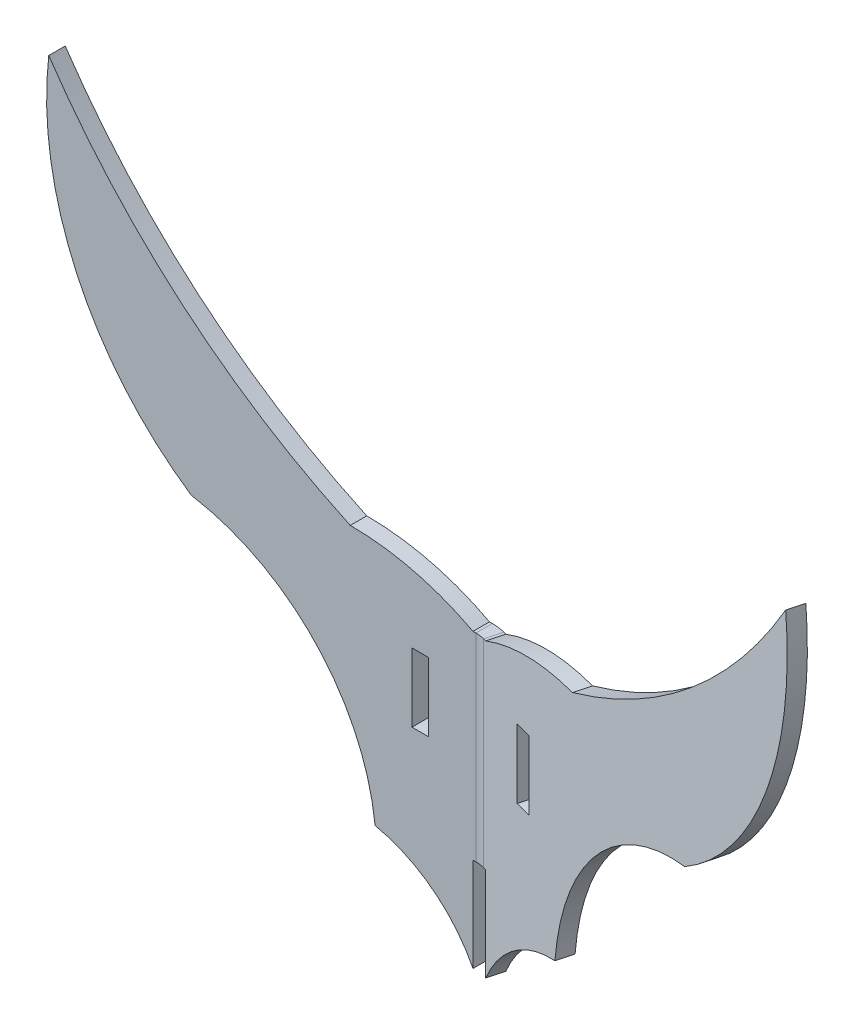
ISO-10303-21;
HEADER;
FILE_DESCRIPTION(('STEP AP214'),'2;1');
FILE_NAME('part.step','',(''),(''),'','','');
FILE_SCHEMA(('AUTOMOTIVE_DESIGN { 1 0 10303 214 1 1 1 1 }'));
ENDSEC;
DATA;
#1=APPLICATION_CONTEXT('core data for automotive mechanical design processes');
#2=APPLICATION_PROTOCOL_DEFINITION('international standard','automotive_design',2000,#1);
#3=PRODUCT_CONTEXT('',#1,'mechanical');
#4=PRODUCT('Part','Part','',(#3));
#5=PRODUCT_RELATED_PRODUCT_CATEGORY('part','',(#4));
#6=PRODUCT_DEFINITION_FORMATION('','',#4);
#7=PRODUCT_DEFINITION_CONTEXT('part definition',#1,'design');
#8=PRODUCT_DEFINITION('design','',#6,#7);
#9=PRODUCT_DEFINITION_SHAPE('','',#8);
#10=(LENGTH_UNIT() NAMED_UNIT(*) SI_UNIT(.MILLI.,.METRE.));
#11=(NAMED_UNIT(*) PLANE_ANGLE_UNIT() SI_UNIT($,.RADIAN.));
#12=(NAMED_UNIT(*) SI_UNIT($,.STERADIAN.) SOLID_ANGLE_UNIT());
#13=UNCERTAINTY_MEASURE_WITH_UNIT(LENGTH_MEASURE(1.E-05),#10,'distance_accuracy_value','');
#14=(GEOMETRIC_REPRESENTATION_CONTEXT(3) GLOBAL_UNCERTAINTY_ASSIGNED_CONTEXT((#13)) GLOBAL_UNIT_ASSIGNED_CONTEXT((#10,
#11,#12)) REPRESENTATION_CONTEXT('',''));
#15=CARTESIAN_POINT('',(0.,0.,0.));
#16=DIRECTION('',(0.,0.,1.));
#17=DIRECTION('',(1.,0.,0.));
#18=AXIS2_PLACEMENT_3D('',#15,#16,#17);
#19=CARTESIAN_POINT('',(12.759274172426,200.474249065526,3.23481289353456));
#20=DIRECTION('',(0.258819045102521,0.,-0.965925826289068));
#21=DIRECTION('',(-0.965925826289068,0.,-0.258819045102521));
#22=AXIS2_PLACEMENT_3D('',#19,#20,#21);
#23=PLANE('',#22);
#24=DIRECTION('',(0.965925826289068,0.,0.258819045102521));
#25=VECTOR('',#24,1.);
#26=CARTESIAN_POINT('',(5.33314516650484,223.0507730184,1.24498762350864));
#27=LINE('',#26,#25);
#28=CARTESIAN_POINT('',(5.33314516650484,223.0507730184,1.24498762350864));
#29=VERTEX_POINT('',#28);
#30=CARTESIAN_POINT('',(6.80521612576938,223.0507730184,1.63942784824488));
#31=VERTEX_POINT('',#30);
#32=EDGE_CURVE('E340',#29,#31,#27,.T.);
#33=ORIENTED_EDGE('',*,*,#32,.F.);
#34=DIRECTION('',(0.,-1.,0.));
#35=VECTOR('',#34,1.);
#36=CARTESIAN_POINT('',(5.33314516650484,229.4007730184,1.24498762350864));
#37=LINE('',#36,#35);
#38=CARTESIAN_POINT('',(5.33314516650484,229.4007730184,1.24498762350864));
#39=VERTEX_POINT('',#38);
#40=EDGE_CURVE('E338',#39,#29,#37,.T.);
#41=ORIENTED_EDGE('',*,*,#40,.F.);
#42=DIRECTION('',(-0.965925826289068,0.,-0.258819045102521));
#43=VECTOR('',#42,1.);
#44=CARTESIAN_POINT('',(5.33314516650484,229.4007730184,1.24498762350864));
#45=LINE('',#44,#43);
#46=CARTESIAN_POINT('',(6.80521612576938,229.4007730184,1.63942784824488));
#47=VERTEX_POINT('',#46);
#48=EDGE_CURVE('E328',#47,#39,#45,.T.);
#49=ORIENTED_EDGE('',*,*,#48,.F.);
#50=DIRECTION('',(0.,1.,0.));
#51=VECTOR('',#50,1.);
#52=CARTESIAN_POINT('',(6.80521612576938,229.4007730184,1.63942784824488));
#53=LINE('',#52,#51);
#54=EDGE_CURVE('E344',#31,#47,#53,.T.);
#55=ORIENTED_EDGE('',*,*,#54,.F.);
#56=EDGE_LOOP('',(#33,#41,#49,#55));
#57=FACE_BOUND('',#56,.T.);
#58=DIRECTION('',(-0.965925826289068,0.,-0.258819045102521));
#59=VECTOR('',#58,1.);
#60=CARTESIAN_POINT('',(-0.121896494760621,233.551760084195,-0.216686384305577));
#61=LINE('',#60,#59);
#62=CARTESIAN_POINT('',(1.35017446450392,233.551760084195,0.177753840430666));
#63=VERTEX_POINT('',#62);
#64=CARTESIAN_POINT('',(1.09054188913671,233.551760084195,0.108185501532209));
#65=VERTEX_POINT('',#64);
#66=EDGE_CURVE('E64',#63,#65,#61,.T.);
#67=ORIENTED_EDGE('',*,*,#66,.T.);
#68=DIRECTION('',(0.,-1.,0.));
#69=VECTOR('',#68,1.);
#70=CARTESIAN_POINT('',(1.09054188913671,200.474249065526,0.108185501532209));
#71=LINE('',#70,#69);
#72=CARTESIAN_POINT('',(1.09054188913671,215.212870579898,0.108185501532209));
#73=VERTEX_POINT('',#72);
#74=EDGE_CURVE('E56',#65,#73,#71,.T.);
#75=ORIENTED_EDGE('',*,*,#74,.T.);
#76=DIRECTION('',(0.965925826289068,0.,0.258819045102521));
#77=VECTOR('',#76,1.);
#78=CARTESIAN_POINT('',(0.614138984871649,215.212870579898,-0.0194662719374556));
#79=LINE('',#78,#77);
#80=CARTESIAN_POINT('',(1.35017446450392,215.212870579898,0.177753840430666));
#81=VERTEX_POINT('',#80);
#82=EDGE_CURVE('E72',#73,#81,#79,.T.);
#83=ORIENTED_EDGE('',*,*,#82,.T.);
#84=DIRECTION('',(0.,-1.,0.));
#85=VECTOR('',#84,1.);
#86=CARTESIAN_POINT('',(1.35017446450392,215.212870579898,0.177753840430666));
#87=LINE('',#86,#85);
#88=CARTESIAN_POINT('',(1.35017446450392,206.537075799162,0.177753840430666));
#89=VERTEX_POINT('',#88);
#90=EDGE_CURVE('E376',#81,#89,#87,.T.);
#91=ORIENTED_EDGE('',*,*,#90,.T.);
#92=CARTESIAN_POINT('',(12.759274172426,200.474249065526,3.23481289353456));
#93=DIRECTION('',(0.258819045102521,0.,-0.965925826289068));
#94=DIRECTION('',(-0.965925826289068,0.,-0.258819045102521));
#95=AXIS2_PLACEMENT_3D('',#92,#93,#94);
#96=CIRCLE('',#95,13.2767102175786);
#97=CARTESIAN_POINT('',(10.1017325464061,213.462760914363,2.52272676099043));
#98=VERTEX_POINT('',#97);
#99=EDGE_CURVE('E379',#89,#98,#96,.T.);
#100=ORIENTED_EDGE('',*,*,#99,.T.);
#101=CARTESIAN_POINT('',(29.7279997646015,211.251059383277,7.7815692125433));
#102=DIRECTION('',(0.258819045102521,0.,-0.965925826289068));
#103=DIRECTION('',(-0.965925826289068,0.,-0.258819045102521));
#104=AXIS2_PLACEMENT_3D('',#101,#102,#103);
#105=CIRCLE('',#104,20.4386255044921);
#106=CARTESIAN_POINT('',(26.525494774196,231.418980046682,6.92346058660752));
#107=VERTEX_POINT('',#106);
#108=EDGE_CURVE('E382',#98,#107,#105,.T.);
#109=ORIENTED_EDGE('',*,*,#108,.T.);
#110=CARTESIAN_POINT('',(10.1387816985333,256.594170402523,2.53265405138316));
#111=DIRECTION('',(-0.258819045102521,0.,0.965925826289068));
#112=DIRECTION('',(0.965925826289068,0.,0.258819045102521));
#113=AXIS2_PLACEMENT_3D('',#110,#111,#112);
#114=CIRCLE('',#113,30.3577627124715);
#115=CARTESIAN_POINT('',(39.2695493411971,260.067681322201,10.3382197161336));
#116=VERTEX_POINT('',#115);
#117=EDGE_CURVE('E385',#107,#116,#114,.T.);
#118=ORIENTED_EDGE('',*,*,#117,.T.);
#119=CARTESIAN_POINT('',(-15.283177393454,298.27200828736,-4.27913935733189));
#120=DIRECTION('',(0.258819045102521,0.,-0.965925826289068));
#121=DIRECTION('',(-0.965925826289068,0.,-0.258819045102521));
#122=AXIS2_PLACEMENT_3D('',#119,#120,#121);
#123=CIRCLE('',#122,68.1853193827592);
#124=CARTESIAN_POINT('',(12.3207421256857,236.364383843072,3.11730858575531));
#125=VERTEX_POINT('',#124);
#126=EDGE_CURVE('E388',#116,#125,#123,.T.);
#127=ORIENTED_EDGE('',*,*,#126,.T.);
#128=CARTESIAN_POINT('',(12.3207421256856,212.026754452324,3.11730858575531));
#129=DIRECTION('',(-0.258819045102521,0.,0.965925826289068));
#130=DIRECTION('',(0.965925826289068,0.,0.258819045102521));
#131=AXIS2_PLACEMENT_3D('',#128,#129,#130);
#132=CIRCLE('',#131,24.3376293907481);
#133=EDGE_CURVE('E391',#125,#63,#132,.T.);
#134=ORIENTED_EDGE('',*,*,#133,.T.);
#135=EDGE_LOOP('',(#67,#75,#83,#91,#100,#109,#118,#127,#134));
#136=FACE_BOUND('',#135,.T.);
#137=ADVANCED_FACE('F47',(#57,#136),#23,.F.);
#138=CARTESIAN_POINT('',(0.272543729975622,233.551760084195,-1.68875734357012));
#139=DIRECTION('',(0.,1.,0.));
#140=DIRECTION('',(-0.258819045102521,0.,0.965925826289068));
#141=AXIS2_PLACEMENT_3D('',#138,#139,#140);
#142=PLANE('',#141);
#143=DIRECTION('',(0.258819045102521,0.,-0.965925826289068));
#144=VECTOR('',#143,1.);
#145=CARTESIAN_POINT('',(1.48498211387295,233.551760084195,-1.36388545773233));
#146=LINE('',#145,#144);
#147=CARTESIAN_POINT('',(1.48498211387295,233.551760084195,-1.36388545773233));
#148=VERTEX_POINT('',#147);
#149=EDGE_CURVE('E12',#65,#148,#146,.T.);
#150=ORIENTED_EDGE('',*,*,#149,.F.);
#151=ORIENTED_EDGE('',*,*,#66,.F.);
#152=DIRECTION('',(-0.258819045102521,0.,0.965925826289068));
#153=VECTOR('',#152,1.);
#154=CARTESIAN_POINT('',(1.74461468924016,233.551760084195,-1.29431711883387));
#155=LINE('',#154,#153);
#156=CARTESIAN_POINT('',(1.74461468924016,233.551760084195,-1.29431711883387));
#157=VERTEX_POINT('',#156);
#158=EDGE_CURVE('E393',#157,#63,#155,.T.);
#159=ORIENTED_EDGE('',*,*,#158,.F.);
#160=DIRECTION('',(-0.965925826289068,0.,-0.258819045102521));
#161=VECTOR('',#160,1.);
#162=CARTESIAN_POINT('',(0.272543729975622,233.551760084195,-1.68875734357012));
#163=LINE('',#162,#161);
#164=EDGE_CURVE('E375',#157,#148,#163,.T.);
#165=ORIENTED_EDGE('',*,*,#164,.T.);
#166=EDGE_LOOP('',(#150,#151,#159,#165));
#167=FACE_BOUND('',#166,.T.);
#168=ADVANCED_FACE('F49',(#167),#142,.T.);
#169=CARTESIAN_POINT('',(12.7151823504219,212.026754452324,1.64523762649077));
#170=DIRECTION('',(-0.258819045102521,0.,0.965925826289068));
#171=DIRECTION('',(0.965925826289068,0.,0.258819045102521));
#172=AXIS2_PLACEMENT_3D('',#169,#170,#171);
#173=CYLINDRICAL_SURFACE('',#172,24.3376293907481);
#174=ORIENTED_EDGE('',*,*,#133,.F.);
#175=DIRECTION('',(-0.258819045102521,0.,0.965925826289068));
#176=VECTOR('',#175,1.);
#177=CARTESIAN_POINT('',(12.7151823504219,236.364383843072,1.64523762649077));
#178=LINE('',#177,#176);
#179=CARTESIAN_POINT('',(12.7151823504219,236.364383843072,1.64523762649077));
#180=VERTEX_POINT('',#179);
#181=EDGE_CURVE('E395',#180,#125,#178,.T.);
#182=ORIENTED_EDGE('',*,*,#181,.F.);
#183=CARTESIAN_POINT('',(12.7151823504219,212.026754452324,1.64523762649077));
#184=DIRECTION('',(-0.258819045102521,0.,0.965925826289068));
#185=DIRECTION('',(0.965925826289068,0.,0.258819045102521));
#186=AXIS2_PLACEMENT_3D('',#183,#184,#185);
#187=CIRCLE('',#186,24.3376293907481);
#188=EDGE_CURVE('E372',#180,#157,#187,.T.);
#189=ORIENTED_EDGE('',*,*,#188,.T.);
#190=ORIENTED_EDGE('',*,*,#158,.T.);
#191=EDGE_LOOP('',(#174,#182,#189,#190));
#192=FACE_BOUND('',#191,.T.);
#193=ADVANCED_FACE('F511',(#192),#173,.T.);
#194=CARTESIAN_POINT('',(-14.8887371687178,298.27200828736,-5.75121031659643));
#195=DIRECTION('',(-0.258819045102521,0.,0.965925826289068));
#196=DIRECTION('',(0.965925826289068,0.,0.258819045102521));
#197=AXIS2_PLACEMENT_3D('',#194,#195,#196);
#198=CYLINDRICAL_SURFACE('',#197,68.1853193827592);
#199=ORIENTED_EDGE('',*,*,#126,.F.);
#200=DIRECTION('',(-0.258819045102521,0.,0.965925826289068));
#201=VECTOR('',#200,1.);
#202=CARTESIAN_POINT('',(39.6639895659333,260.067681322201,8.86614875686909));
#203=LINE('',#202,#201);
#204=CARTESIAN_POINT('',(39.6639895659333,260.067681322201,8.86614875686909));
#205=VERTEX_POINT('',#204);
#206=EDGE_CURVE('E397',#205,#116,#203,.T.);
#207=ORIENTED_EDGE('',*,*,#206,.F.);
#208=CARTESIAN_POINT('',(-14.8887371687178,298.27200828736,-5.75121031659643));
#209=DIRECTION('',(0.258819045102521,0.,-0.965925826289068));
#210=DIRECTION('',(-0.965925826289068,0.,-0.258819045102521));
#211=AXIS2_PLACEMENT_3D('',#208,#209,#210);
#212=CIRCLE('',#211,68.1853193827592);
#213=EDGE_CURVE('E369',#205,#180,#212,.T.);
#214=ORIENTED_EDGE('',*,*,#213,.T.);
#215=ORIENTED_EDGE('',*,*,#181,.T.);
#216=EDGE_LOOP('',(#199,#207,#214,#215));
#217=FACE_BOUND('',#216,.T.);
#218=ADVANCED_FACE('F531',(#217),#198,.F.);
#219=CARTESIAN_POINT('',(10.5332219232695,256.594170402523,1.06058309211862));
#220=DIRECTION('',(-0.258819045102521,0.,0.965925826289068));
#221=DIRECTION('',(0.965925826289068,0.,0.258819045102521));
#222=AXIS2_PLACEMENT_3D('',#219,#220,#221);
#223=CYLINDRICAL_SURFACE('',#222,30.3577627124715);
#224=ORIENTED_EDGE('',*,*,#117,.F.);
#225=DIRECTION('',(-0.258819045102521,0.,0.965925826289068));
#226=VECTOR('',#225,1.);
#227=CARTESIAN_POINT('',(26.9199349989323,231.418980046682,5.45138962734298));
#228=LINE('',#227,#226);
#229=CARTESIAN_POINT('',(26.9199349989323,231.418980046682,5.45138962734298));
#230=VERTEX_POINT('',#229);
#231=EDGE_CURVE('E399',#230,#107,#228,.T.);
#232=ORIENTED_EDGE('',*,*,#231,.F.);
#233=CARTESIAN_POINT('',(10.5332219232695,256.594170402523,1.06058309211862));
#234=DIRECTION('',(-0.258819045102521,0.,0.965925826289068));
#235=DIRECTION('',(0.965925826289068,0.,0.258819045102521));
#236=AXIS2_PLACEMENT_3D('',#233,#234,#235);
#237=CIRCLE('',#236,30.3577627124715);
#238=EDGE_CURVE('E366',#230,#205,#237,.T.);
#239=ORIENTED_EDGE('',*,*,#238,.T.);
#240=ORIENTED_EDGE('',*,*,#206,.T.);
#241=EDGE_LOOP('',(#224,#232,#239,#240));
#242=FACE_BOUND('',#241,.T.);
#243=ADVANCED_FACE('F527',(#242),#223,.T.);
#244=CARTESIAN_POINT('',(30.1224399893377,211.251059383277,6.30949825327876));
#245=DIRECTION('',(-0.258819045102521,0.,0.965925826289068));
#246=DIRECTION('',(0.965925826289068,0.,0.258819045102521));
#247=AXIS2_PLACEMENT_3D('',#244,#245,#246);
#248=CYLINDRICAL_SURFACE('',#247,20.4386255044921);
#249=ORIENTED_EDGE('',*,*,#108,.F.);
#250=DIRECTION('',(-0.258819045102521,0.,0.965925826289068));
#251=VECTOR('',#250,1.);
#252=CARTESIAN_POINT('',(10.4961727711423,213.462760914363,1.05065580172589));
#253=LINE('',#252,#251);
#254=CARTESIAN_POINT('',(10.4961727711423,213.462760914363,1.05065580172589));
#255=VERTEX_POINT('',#254);
#256=EDGE_CURVE('E401',#255,#98,#253,.T.);
#257=ORIENTED_EDGE('',*,*,#256,.F.);
#258=CARTESIAN_POINT('',(30.1224399893377,211.251059383277,6.30949825327876));
#259=DIRECTION('',(0.258819045102521,0.,-0.965925826289068));
#260=DIRECTION('',(-0.965925826289068,0.,-0.258819045102521));
#261=AXIS2_PLACEMENT_3D('',#258,#259,#260);
#262=CIRCLE('',#261,20.4386255044921);
#263=EDGE_CURVE('E363',#255,#230,#262,.T.);
#264=ORIENTED_EDGE('',*,*,#263,.T.);
#265=ORIENTED_EDGE('',*,*,#231,.T.);
#266=EDGE_LOOP('',(#249,#257,#264,#265));
#267=FACE_BOUND('',#266,.T.);
#268=ADVANCED_FACE('F524',(#267),#248,.F.);
#269=CARTESIAN_POINT('',(13.1537143971623,200.474249065526,1.76274193427002));
#270=DIRECTION('',(-0.258819045102521,0.,0.965925826289068));
#271=DIRECTION('',(0.965925826289068,0.,0.258819045102521));
#272=AXIS2_PLACEMENT_3D('',#269,#270,#271);
#273=CYLINDRICAL_SURFACE('',#272,13.2767102175786);
#274=ORIENTED_EDGE('',*,*,#99,.F.);
#275=DIRECTION('',(-0.258819045102521,0.,0.965925826289068));
#276=VECTOR('',#275,1.);
#277=CARTESIAN_POINT('',(1.74461468924016,206.537075799162,-1.29431711883387));
#278=LINE('',#277,#276);
#279=CARTESIAN_POINT('',(1.74461468924016,206.537075799162,-1.29431711883387));
#280=VERTEX_POINT('',#279);
#281=EDGE_CURVE('E403',#280,#89,#278,.T.);
#282=ORIENTED_EDGE('',*,*,#281,.F.);
#283=CARTESIAN_POINT('',(13.1537143971623,200.474249065526,1.76274193427002));
#284=DIRECTION('',(0.258819045102521,0.,-0.965925826289068));
#285=DIRECTION('',(-0.965925826289068,0.,-0.258819045102521));
#286=AXIS2_PLACEMENT_3D('',#283,#284,#285);
#287=CIRCLE('',#286,13.2767102175786);
#288=EDGE_CURVE('E360',#280,#255,#287,.T.);
#289=ORIENTED_EDGE('',*,*,#288,.T.);
#290=ORIENTED_EDGE('',*,*,#256,.T.);
#291=EDGE_LOOP('',(#274,#282,#289,#290));
#292=FACE_BOUND('',#291,.T.);
#293=ADVANCED_FACE('F428',(#292),#273,.F.);
#294=CARTESIAN_POINT('',(1.74461468924016,215.212870579898,-1.29431711883387));
#295=DIRECTION('',(-0.965925826289068,0.,-0.258819045102521));
#296=DIRECTION('',(-0.258819045102521,0.,0.965925826289068));
#297=AXIS2_PLACEMENT_3D('',#294,#295,#296);
#298=PLANE('',#297);
#299=ORIENTED_EDGE('',*,*,#90,.F.);
#300=DIRECTION('',(-0.258819045102521,0.,0.965925826289068));
#301=VECTOR('',#300,1.);
#302=CARTESIAN_POINT('',(1.74461468924016,215.212870579898,-1.29431711883387));
#303=LINE('',#302,#301);
#304=CARTESIAN_POINT('',(1.74461468924016,215.212870579898,-1.29431711883387));
#305=VERTEX_POINT('',#304);
#306=EDGE_CURVE('E405',#305,#81,#303,.T.);
#307=ORIENTED_EDGE('',*,*,#306,.F.);
#308=DIRECTION('',(0.,-1.,0.));
#309=VECTOR('',#308,1.);
#310=CARTESIAN_POINT('',(1.74461468924016,215.212870579898,-1.29431711883387));
#311=LINE('',#310,#309);
#312=EDGE_CURVE('E357',#305,#280,#311,.T.);
#313=ORIENTED_EDGE('',*,*,#312,.T.);
#314=ORIENTED_EDGE('',*,*,#281,.T.);
#315=EDGE_LOOP('',(#299,#307,#313,#314));
#316=FACE_BOUND('',#315,.T.);
#317=ADVANCED_FACE('F420',(#316),#298,.T.);
#318=CARTESIAN_POINT('',(1.00857920960789,215.212870579898,-1.491537231202));
#319=DIRECTION('',(0.,-1.,0.));
#320=DIRECTION('',(0.258819045102521,0.,-0.965925826289068));
#321=AXIS2_PLACEMENT_3D('',#318,#319,#320);
#322=PLANE('',#321);
#323=DIRECTION('',(-0.258819045102521,0.,0.965925826289068));
#324=VECTOR('',#323,1.);
#325=CARTESIAN_POINT('',(1.48498211387295,215.212870579898,-1.36388545773233));
#326=LINE('',#325,#324);
#327=CARTESIAN_POINT('',(1.48498211387295,215.212870579898,-1.36388545773233));
#328=VERTEX_POINT('',#327);
#329=EDGE_CURVE('E408',#328,#73,#326,.T.);
#330=ORIENTED_EDGE('',*,*,#329,.F.);
#331=DIRECTION('',(0.965925826289068,0.,0.258819045102521));
#332=VECTOR('',#331,1.);
#333=CARTESIAN_POINT('',(0.272543729975621,215.212870579898,-1.68875734357012));
#334=LINE('',#333,#332);
#335=EDGE_CURVE('E51',#328,#305,#334,.T.);
#336=ORIENTED_EDGE('',*,*,#335,.T.);
#337=ORIENTED_EDGE('',*,*,#306,.T.);
#338=ORIENTED_EDGE('',*,*,#82,.F.);
#339=EDGE_LOOP('',(#330,#336,#337,#338));
#340=FACE_BOUND('',#339,.T.);
#341=ADVANCED_FACE('F415',(#340),#322,.T.);
#342=CARTESIAN_POINT('',(13.1537143971623,200.474249065526,1.76274193427002));
#343=DIRECTION('',(0.258819045102521,0.,-0.965925826289068));
#344=DIRECTION('',(-0.965925826289068,0.,-0.258819045102521));
#345=AXIS2_PLACEMENT_3D('',#342,#343,#344);
#346=PLANE('',#345);
#347=DIRECTION('',(0.,-1.,0.));
#348=VECTOR('',#347,1.);
#349=CARTESIAN_POINT('',(1.48498211387295,200.474249065526,-1.36388545773233));
#350=LINE('',#349,#348);
#351=EDGE_CURVE('E243',#148,#328,#350,.T.);
#352=ORIENTED_EDGE('',*,*,#351,.F.);
#353=ORIENTED_EDGE('',*,*,#164,.F.);
#354=ORIENTED_EDGE('',*,*,#188,.F.);
#355=ORIENTED_EDGE('',*,*,#213,.F.);
#356=ORIENTED_EDGE('',*,*,#238,.F.);
#357=ORIENTED_EDGE('',*,*,#263,.F.);
#358=ORIENTED_EDGE('',*,*,#288,.F.);
#359=ORIENTED_EDGE('',*,*,#312,.F.);
#360=ORIENTED_EDGE('',*,*,#335,.F.);
#361=EDGE_LOOP('',(#352,#353,#354,#355,#356,#357,#358,#359,#360));
#362=FACE_BOUND('',#361,.T.);
#363=DIRECTION('',(0.,-1.,0.));
#364=VECTOR('',#363,1.);
#365=CARTESIAN_POINT('',(5.72758539124108,229.4007730184,-0.227083335755904));
#366=LINE('',#365,#364);
#367=CARTESIAN_POINT('',(5.72758539124108,229.4007730184,-0.227083335755904));
#368=VERTEX_POINT('',#367);
#369=CARTESIAN_POINT('',(5.72758539124108,223.0507730184,-0.227083335755904));
#370=VERTEX_POINT('',#369);
#371=EDGE_CURVE('E324',#368,#370,#366,.T.);
#372=ORIENTED_EDGE('',*,*,#371,.T.);
#373=DIRECTION('',(0.965925826289068,0.,0.258819045102521));
#374=VECTOR('',#373,1.);
#375=CARTESIAN_POINT('',(5.72758539124108,223.0507730184,-0.227083335755904));
#376=LINE('',#375,#374);
#377=CARTESIAN_POINT('',(7.19965635050562,223.0507730184,0.167356888980339));
#378=VERTEX_POINT('',#377);
#379=EDGE_CURVE('E327',#370,#378,#376,.T.);
#380=ORIENTED_EDGE('',*,*,#379,.T.);
#381=DIRECTION('',(0.,1.,0.));
#382=VECTOR('',#381,1.);
#383=CARTESIAN_POINT('',(7.19965635050562,229.4007730184,0.167356888980339));
#384=LINE('',#383,#382);
#385=CARTESIAN_POINT('',(7.19965635050562,229.4007730184,0.167356888980339));
#386=VERTEX_POINT('',#385);
#387=EDGE_CURVE('E331',#378,#386,#384,.T.);
#388=ORIENTED_EDGE('',*,*,#387,.T.);
#389=DIRECTION('',(-0.965925826289068,0.,-0.258819045102521));
#390=VECTOR('',#389,1.);
#391=CARTESIAN_POINT('',(5.72758539124108,229.4007730184,-0.227083335755904));
#392=LINE('',#391,#390);
#393=EDGE_CURVE('E334',#386,#368,#392,.T.);
#394=ORIENTED_EDGE('',*,*,#393,.T.);
#395=EDGE_LOOP('',(#372,#380,#388,#394));
#396=FACE_BOUND('',#395,.T.);
#397=ADVANCED_FACE('F422',(#362,#396),#346,.T.);
#398=CARTESIAN_POINT('',(5.72758539124108,229.4007730184,-0.227083335755904));
#399=DIRECTION('',(-0.965925826289068,0.,-0.258819045102521));
#400=DIRECTION('',(0.,-1.,0.));
#401=AXIS2_PLACEMENT_3D('',#398,#399,#400);
#402=PLANE('',#401);
#403=ORIENTED_EDGE('',*,*,#40,.T.);
#404=DIRECTION('',(-0.258819045102521,0.,0.965925826289068));
#405=VECTOR('',#404,1.);
#406=CARTESIAN_POINT('',(5.72758539124108,223.0507730184,-0.227083335755904));
#407=LINE('',#406,#405);
#408=EDGE_CURVE('E337',#370,#29,#407,.T.);
#409=ORIENTED_EDGE('',*,*,#408,.F.);
#410=ORIENTED_EDGE('',*,*,#371,.F.);
#411=DIRECTION('',(-0.258819045102521,0.,0.965925826289068));
#412=VECTOR('',#411,1.);
#413=CARTESIAN_POINT('',(5.72758539124108,229.4007730184,-0.227083335755904));
#414=LINE('',#413,#412);
#415=EDGE_CURVE('E349',#368,#39,#414,.T.);
#416=ORIENTED_EDGE('',*,*,#415,.T.);
#417=EDGE_LOOP('',(#403,#409,#410,#416));
#418=FACE_BOUND('',#417,.T.);
#419=ADVANCED_FACE('F519',(#418),#402,.F.);
#420=CARTESIAN_POINT('',(5.72758539124108,229.4007730184,-0.227083335755904));
#421=DIRECTION('',(0.,1.,0.));
#422=DIRECTION('',(-0.258819045102521,0.,0.965925826289068));
#423=AXIS2_PLACEMENT_3D('',#420,#421,#422);
#424=PLANE('',#423);
#425=ORIENTED_EDGE('',*,*,#48,.T.);
#426=ORIENTED_EDGE('',*,*,#415,.F.);
#427=ORIENTED_EDGE('',*,*,#393,.F.);
#428=DIRECTION('',(-0.258819045102521,0.,0.965925826289068));
#429=VECTOR('',#428,1.);
#430=CARTESIAN_POINT('',(7.19965635050562,229.4007730184,0.167356888980339));
#431=LINE('',#430,#429);
#432=EDGE_CURVE('E351',#386,#47,#431,.T.);
#433=ORIENTED_EDGE('',*,*,#432,.T.);
#434=EDGE_LOOP('',(#425,#426,#427,#433));
#435=FACE_BOUND('',#434,.T.);
#436=ADVANCED_FACE('F541',(#435),#424,.F.);
#437=CARTESIAN_POINT('',(7.19965635050562,229.4007730184,0.167356888980339));
#438=DIRECTION('',(0.965925826289068,0.,0.258819045102521));
#439=DIRECTION('',(0.,1.,0.));
#440=AXIS2_PLACEMENT_3D('',#437,#438,#439);
#441=PLANE('',#440);
#442=ORIENTED_EDGE('',*,*,#54,.T.);
#443=ORIENTED_EDGE('',*,*,#432,.F.);
#444=ORIENTED_EDGE('',*,*,#387,.F.);
#445=DIRECTION('',(-0.258819045102521,0.,0.965925826289068));
#446=VECTOR('',#445,1.);
#447=CARTESIAN_POINT('',(7.19965635050562,223.0507730184,0.167356888980339));
#448=LINE('',#447,#446);
#449=EDGE_CURVE('E353',#378,#31,#448,.T.);
#450=ORIENTED_EDGE('',*,*,#449,.T.);
#451=EDGE_LOOP('',(#442,#443,#444,#450));
#452=FACE_BOUND('',#451,.T.);
#453=ADVANCED_FACE('F546',(#452),#441,.F.);
#454=CARTESIAN_POINT('',(5.72758539124108,223.0507730184,-0.227083335755904));
#455=DIRECTION('',(0.,-1.,0.));
#456=DIRECTION('',(0.258819045102521,0.,-0.965925826289068));
#457=AXIS2_PLACEMENT_3D('',#454,#455,#456);
#458=PLANE('',#457);
#459=ORIENTED_EDGE('',*,*,#32,.T.);
#460=ORIENTED_EDGE('',*,*,#449,.F.);
#461=ORIENTED_EDGE('',*,*,#379,.F.);
#462=ORIENTED_EDGE('',*,*,#408,.T.);
#463=EDGE_LOOP('',(#459,#460,#461,#462));
#464=FACE_BOUND('',#463,.T.);
#465=ADVANCED_FACE('F543',(#464),#458,.F.);
#466=CARTESIAN_POINT('',(-11.3575673851986,212.026754452324,-1.524));
#467=DIRECTION('',(0.,0.,1.));
#468=DIRECTION('',(1.,0.,0.));
#469=AXIS2_PLACEMENT_3D('',#466,#467,#468);
#470=CYLINDRICAL_SURFACE('',#469,24.3376293907481);
#471=CARTESIAN_POINT('',(-11.3575673851986,212.026754452324,0.));
#472=DIRECTION('',(0.,0.,1.));
#473=DIRECTION('',(-1.,0.,0.));
#474=AXIS2_PLACEMENT_3D('',#471,#472,#473);
#475=CIRCLE('',#474,24.3376293907481);
#476=CARTESIAN_POINT('',(0.,233.551760084195,0.));
#477=VERTEX_POINT('',#476);
#478=CARTESIAN_POINT('',(-11.3575673851986,236.364383843072,0.));
#479=VERTEX_POINT('',#478);
#480=EDGE_CURVE('E464',#477,#479,#475,.T.);
#481=ORIENTED_EDGE('',*,*,#480,.F.);
#482=DIRECTION('',(0.,0.,1.));
#483=VECTOR('',#482,1.);
#484=CARTESIAN_POINT('',(0.,233.551760084195,-1.524));
#485=LINE('',#484,#483);
#486=CARTESIAN_POINT('',(0.,233.551760084195,-1.524));
#487=VERTEX_POINT('',#486);
#488=EDGE_CURVE('E341',#487,#477,#485,.T.);
#489=ORIENTED_EDGE('',*,*,#488,.F.);
#490=CARTESIAN_POINT('',(-11.3575673851986,212.026754452324,-1.524));
#491=DIRECTION('',(0.,0.,1.));
#492=DIRECTION('',(-1.,0.,0.));
#493=AXIS2_PLACEMENT_3D('',#490,#491,#492);
#494=CIRCLE('',#493,24.3376293907481);
#495=CARTESIAN_POINT('',(-11.3575673851986,236.364383843072,-1.524));
#496=VERTEX_POINT('',#495);
#497=EDGE_CURVE('E320',#487,#496,#494,.T.);
#498=ORIENTED_EDGE('',*,*,#497,.T.);
#499=DIRECTION('',(0.,0.,1.));
#500=VECTOR('',#499,1.);
#501=CARTESIAN_POINT('',(-11.3575673851986,236.364383843072,-1.524));
#502=LINE('',#501,#500);
#503=EDGE_CURVE('E318',#496,#479,#502,.T.);
#504=ORIENTED_EDGE('',*,*,#503,.T.);
#505=EDGE_LOOP('',(#481,#489,#498,#504));
#506=FACE_BOUND('',#505,.T.);
#507=ADVANCED_FACE('F475',(#506),#470,.T.);
#508=CARTESIAN_POINT('',(17.2201129789236,298.27200828736,-1.524));
#509=DIRECTION('',(0.,0.,1.));
#510=DIRECTION('',(1.,0.,0.));
#511=AXIS2_PLACEMENT_3D('',#508,#509,#510);
#512=CYLINDRICAL_SURFACE('',#511,68.1853193827592);
#513=CARTESIAN_POINT('',(17.2201129789236,298.27200828736,0.));
#514=DIRECTION('',(0.,0.,-1.));
#515=DIRECTION('',(1.,0.,0.));
#516=AXIS2_PLACEMENT_3D('',#513,#514,#515);
#517=CIRCLE('',#516,68.1853193827592);
#518=CARTESIAN_POINT('',(-39.257025585881,260.067681322201,0.));
#519=VERTEX_POINT('',#518);
#520=EDGE_CURVE('E461',#479,#519,#517,.T.);
#521=ORIENTED_EDGE('',*,*,#520,.F.);
#522=ORIENTED_EDGE('',*,*,#503,.F.);
#523=CARTESIAN_POINT('',(17.2201129789236,298.27200828736,-1.524));
#524=DIRECTION('',(0.,0.,-1.));
#525=DIRECTION('',(1.,0.,0.));
#526=AXIS2_PLACEMENT_3D('',#523,#524,#525);
#527=CIRCLE('',#526,68.1853193827592);
#528=CARTESIAN_POINT('',(-39.257025585881,260.067681322201,-1.524));
#529=VERTEX_POINT('',#528);
#530=EDGE_CURVE('E315',#496,#529,#527,.T.);
#531=ORIENTED_EDGE('',*,*,#530,.T.);
#532=DIRECTION('',(0.,0.,1.));
#533=VECTOR('',#532,1.);
#534=CARTESIAN_POINT('',(-39.257025585881,260.067681322201,-1.524));
#535=LINE('',#534,#533);
#536=EDGE_CURVE('E313',#529,#519,#535,.T.);
#537=ORIENTED_EDGE('',*,*,#536,.T.);
#538=EDGE_LOOP('',(#521,#522,#531,#537));
#539=FACE_BOUND('',#538,.T.);
#540=ADVANCED_FACE('F479',(#539),#512,.F.);
#541=CARTESIAN_POINT('',(-9.09863572837033,256.594170402523,-1.524));
#542=DIRECTION('',(0.,0.,1.));
#543=DIRECTION('',(1.,0.,0.));
#544=AXIS2_PLACEMENT_3D('',#541,#542,#543);
#545=CYLINDRICAL_SURFACE('',#544,30.3577627124715);
#546=CARTESIAN_POINT('',(-9.09863572837033,256.594170402523,0.));
#547=DIRECTION('',(0.,0.,1.));
#548=DIRECTION('',(-1.,0.,0.));
#549=AXIS2_PLACEMENT_3D('',#546,#547,#548);
#550=CIRCLE('',#549,30.3577627124715);
#551=CARTESIAN_POINT('',(-26.0634094508184,231.418980046682,0.));
#552=VERTEX_POINT('',#551);
#553=EDGE_CURVE('E458',#519,#552,#550,.T.);
#554=ORIENTED_EDGE('',*,*,#553,.F.);
#555=ORIENTED_EDGE('',*,*,#536,.F.);
#556=CARTESIAN_POINT('',(-9.09863572837033,256.594170402523,-1.524));
#557=DIRECTION('',(0.,0.,1.));
#558=DIRECTION('',(-1.,0.,0.));
#559=AXIS2_PLACEMENT_3D('',#556,#557,#558);
#560=CIRCLE('',#559,30.3577627124715);
#561=CARTESIAN_POINT('',(-26.0634094508184,231.418980046682,-1.524));
#562=VERTEX_POINT('',#561);
#563=EDGE_CURVE('E310',#529,#562,#560,.T.);
#564=ORIENTED_EDGE('',*,*,#563,.T.);
#565=DIRECTION('',(0.,0.,1.));
#566=VECTOR('',#565,1.);
#567=CARTESIAN_POINT('',(-26.0634094508184,231.418980046682,-1.524));
#568=LINE('',#567,#566);
#569=EDGE_CURVE('E308',#562,#552,#568,.T.);
#570=ORIENTED_EDGE('',*,*,#569,.T.);
#571=EDGE_LOOP('',(#554,#555,#564,#570));
#572=FACE_BOUND('',#571,.T.);
#573=ADVANCED_FACE('F483',(#572),#545,.T.);
#574=CARTESIAN_POINT('',(-29.3788865850296,211.251059383277,-1.524));
#575=DIRECTION('',(0.,0.,1.));
#576=DIRECTION('',(1.,0.,0.));
#577=AXIS2_PLACEMENT_3D('',#574,#575,#576);
#578=CYLINDRICAL_SURFACE('',#577,20.4386255044921);
#579=CARTESIAN_POINT('',(-29.3788865850296,211.251059383277,0.));
#580=DIRECTION('',(0.,0.,-1.));
#581=DIRECTION('',(1.,0.,0.));
#582=AXIS2_PLACEMENT_3D('',#579,#580,#581);
#583=CIRCLE('',#582,20.4386255044921);
#584=CARTESIAN_POINT('',(-9.06027962366868,213.462760914363,0.));
#585=VERTEX_POINT('',#584);
#586=EDGE_CURVE('E455',#552,#585,#583,.T.);
#587=ORIENTED_EDGE('',*,*,#586,.F.);
#588=ORIENTED_EDGE('',*,*,#569,.F.);
#589=CARTESIAN_POINT('',(-29.3788865850296,211.251059383277,-1.524));
#590=DIRECTION('',(0.,0.,-1.));
#591=DIRECTION('',(1.,0.,0.));
#592=AXIS2_PLACEMENT_3D('',#589,#590,#591);
#593=CIRCLE('',#592,20.4386255044921);
#594=CARTESIAN_POINT('',(-9.06027962366868,213.462760914363,-1.524));
#595=VERTEX_POINT('',#594);
#596=EDGE_CURVE('E305',#562,#595,#593,.T.);
#597=ORIENTED_EDGE('',*,*,#596,.T.);
#598=DIRECTION('',(0.,0.,1.));
#599=VECTOR('',#598,1.);
#600=CARTESIAN_POINT('',(-9.06027962366868,213.462760914363,-1.524));
#601=LINE('',#600,#599);
#602=EDGE_CURVE('E303',#595,#585,#601,.T.);
#603=ORIENTED_EDGE('',*,*,#602,.T.);
#604=EDGE_LOOP('',(#587,#588,#597,#603));
#605=FACE_BOUND('',#604,.T.);
#606=ADVANCED_FACE('F487',(#605),#578,.F.);
#607=CARTESIAN_POINT('',(-11.8115691675354,200.474249065526,-1.524));
#608=DIRECTION('',(0.,0.,1.));
#609=DIRECTION('',(1.,0.,0.));
#610=AXIS2_PLACEMENT_3D('',#607,#608,#609);
#611=CYLINDRICAL_SURFACE('',#610,13.2767102175786);
#612=CARTESIAN_POINT('',(-11.8115691675354,200.474249065526,0.));
#613=DIRECTION('',(0.,0.,-1.));
#614=DIRECTION('',(1.,0.,0.));
#615=AXIS2_PLACEMENT_3D('',#612,#613,#614);
#616=CIRCLE('',#615,13.2767102175786);
#617=CARTESIAN_POINT('',(0.,206.537075799162,0.));
#618=VERTEX_POINT('',#617);
#619=EDGE_CURVE('E452',#585,#618,#616,.T.);
#620=ORIENTED_EDGE('',*,*,#619,.F.);
#621=ORIENTED_EDGE('',*,*,#602,.F.);
#622=CARTESIAN_POINT('',(-11.8115691675354,200.474249065526,-1.524));
#623=DIRECTION('',(0.,0.,-1.));
#624=DIRECTION('',(1.,0.,0.));
#625=AXIS2_PLACEMENT_3D('',#622,#623,#624);
#626=CIRCLE('',#625,13.2767102175786);
#627=CARTESIAN_POINT('',(0.,206.537075799162,-1.524));
#628=VERTEX_POINT('',#627);
#629=EDGE_CURVE('E300',#595,#628,#626,.T.);
#630=ORIENTED_EDGE('',*,*,#629,.T.);
#631=DIRECTION('',(0.,0.,1.));
#632=VECTOR('',#631,1.);
#633=CARTESIAN_POINT('',(0.,206.537075799162,-1.524));
#634=LINE('',#633,#632);
#635=EDGE_CURVE('E298',#628,#618,#634,.T.);
#636=ORIENTED_EDGE('',*,*,#635,.T.);
#637=EDGE_LOOP('',(#620,#621,#630,#636));
#638=FACE_BOUND('',#637,.T.);
#639=ADVANCED_FACE('F491',(#638),#611,.F.);
#640=CARTESIAN_POINT('',(0.,206.537075799162,-1.524));
#641=DIRECTION('',(1.,0.,0.));
#642=DIRECTION('',(0.,1.,0.));
#643=AXIS2_PLACEMENT_3D('',#640,#641,#642);
#644=PLANE('',#643);
#645=DIRECTION('',(0.,1.,0.));
#646=VECTOR('',#645,1.);
#647=CARTESIAN_POINT('',(0.,206.537075799162,0.));
#648=LINE('',#647,#646);
#649=CARTESIAN_POINT('',(0.,215.212870579898,0.));
#650=VERTEX_POINT('',#649);
#651=EDGE_CURVE('E449',#618,#650,#648,.T.);
#652=ORIENTED_EDGE('',*,*,#651,.F.);
#653=ORIENTED_EDGE('',*,*,#635,.F.);
#654=DIRECTION('',(0.,1.,0.));
#655=VECTOR('',#654,1.);
#656=CARTESIAN_POINT('',(0.,206.537075799162,-1.524));
#657=LINE('',#656,#655);
#658=CARTESIAN_POINT('',(0.,215.212870579898,-1.524));
#659=VERTEX_POINT('',#658);
#660=EDGE_CURVE('E296',#628,#659,#657,.T.);
#661=ORIENTED_EDGE('',*,*,#660,.T.);
#662=DIRECTION('',(0.,0.,1.));
#663=VECTOR('',#662,1.);
#664=CARTESIAN_POINT('',(0.,215.212870579898,-1.524));
#665=LINE('',#664,#663);
#666=EDGE_CURVE('E260',#659,#650,#665,.T.);
#667=ORIENTED_EDGE('',*,*,#666,.T.);
#668=EDGE_LOOP('',(#652,#653,#661,#667));
#669=FACE_BOUND('',#668,.T.);
#670=ADVANCED_FACE('F494',(#669),#644,.T.);
#671=CARTESIAN_POINT('',(-4.12347469505278,229.4007730184,-1.524));
#672=DIRECTION('',(1.,0.,0.));
#673=DIRECTION('',(0.,1.,0.));
#674=AXIS2_PLACEMENT_3D('',#671,#672,#673);
#675=PLANE('',#674);
#676=DIRECTION('',(0.,1.,0.));
#677=VECTOR('',#676,1.);
#678=CARTESIAN_POINT('',(-4.12347469505278,229.4007730184,0.));
#679=LINE('',#678,#677);
#680=CARTESIAN_POINT('',(-4.12347469505278,223.0507730184,0.));
#681=VERTEX_POINT('',#680);
#682=CARTESIAN_POINT('',(-4.12347469505278,229.4007730184,0.));
#683=VERTEX_POINT('',#682);
#684=EDGE_CURVE('E292',#681,#683,#679,.T.);
#685=ORIENTED_EDGE('',*,*,#684,.T.);
#686=DIRECTION('',(0.,0.,1.));
#687=VECTOR('',#686,1.);
#688=CARTESIAN_POINT('',(-4.12347469505278,229.4007730184,-1.524));
#689=LINE('',#688,#687);
#690=CARTESIAN_POINT('',(-4.12347469505278,229.4007730184,-1.524));
#691=VERTEX_POINT('',#690);
#692=EDGE_CURVE('E275',#691,#683,#689,.T.);
#693=ORIENTED_EDGE('',*,*,#692,.F.);
#694=DIRECTION('',(0.,1.,0.));
#695=VECTOR('',#694,1.);
#696=CARTESIAN_POINT('',(-4.12347469505278,229.4007730184,-1.524));
#697=LINE('',#696,#695);
#698=CARTESIAN_POINT('',(-4.12347469505278,223.0507730184,-1.524));
#699=VERTEX_POINT('',#698);
#700=EDGE_CURVE('E256',#699,#691,#697,.T.);
#701=ORIENTED_EDGE('',*,*,#700,.F.);
#702=DIRECTION('',(0.,0.,1.));
#703=VECTOR('',#702,1.);
#704=CARTESIAN_POINT('',(-4.12347469505278,223.0507730184,-1.524));
#705=LINE('',#704,#703);
#706=EDGE_CURVE('E290',#699,#681,#705,.T.);
#707=ORIENTED_EDGE('',*,*,#706,.T.);
#708=EDGE_LOOP('',(#685,#693,#701,#707));
#709=FACE_BOUND('',#708,.T.);
#710=ADVANCED_FACE('F496',(#709),#675,.F.);
#711=CARTESIAN_POINT('',(-4.12347469505278,223.0507730184,-1.524));
#712=DIRECTION('',(0.,-1.,0.));
#713=DIRECTION('',(0.,0.,-1.));
#714=AXIS2_PLACEMENT_3D('',#711,#712,#713);
#715=PLANE('',#714);
#716=DIRECTION('',(1.,0.,0.));
#717=VECTOR('',#716,1.);
#718=CARTESIAN_POINT('',(-4.12347469505278,223.0507730184,0.));
#719=LINE('',#718,#717);
#720=CARTESIAN_POINT('',(-5.64747469505278,223.0507730184,0.));
#721=VERTEX_POINT('',#720);
#722=EDGE_CURVE('E287',#721,#681,#719,.T.);
#723=ORIENTED_EDGE('',*,*,#722,.T.);
#724=ORIENTED_EDGE('',*,*,#706,.F.);
#725=DIRECTION('',(1.,0.,0.));
#726=VECTOR('',#725,1.);
#727=CARTESIAN_POINT('',(-4.12347469505278,223.0507730184,-1.524));
#728=LINE('',#727,#726);
#729=CARTESIAN_POINT('',(-5.64747469505278,223.0507730184,-1.524));
#730=VERTEX_POINT('',#729);
#731=EDGE_CURVE('E266',#730,#699,#728,.T.);
#732=ORIENTED_EDGE('',*,*,#731,.F.);
#733=DIRECTION('',(0.,0.,1.));
#734=VECTOR('',#733,1.);
#735=CARTESIAN_POINT('',(-5.64747469505278,223.0507730184,-1.524));
#736=LINE('',#735,#734);
#737=EDGE_CURVE('E285',#730,#721,#736,.T.);
#738=ORIENTED_EDGE('',*,*,#737,.T.);
#739=EDGE_LOOP('',(#723,#724,#732,#738));
#740=FACE_BOUND('',#739,.T.);
#741=ADVANCED_FACE('F502',(#740),#715,.F.);
#742=CARTESIAN_POINT('',(-5.64747469505278,229.4007730184,-1.524));
#743=DIRECTION('',(-1.,0.,0.));
#744=DIRECTION('',(0.,-1.,0.));
#745=AXIS2_PLACEMENT_3D('',#742,#743,#744);
#746=PLANE('',#745);
#747=DIRECTION('',(0.,-1.,0.));
#748=VECTOR('',#747,1.);
#749=CARTESIAN_POINT('',(-5.64747469505278,229.4007730184,0.));
#750=LINE('',#749,#748);
#751=CARTESIAN_POINT('',(-5.64747469505278,229.4007730184,0.));
#752=VERTEX_POINT('',#751);
#753=EDGE_CURVE('E282',#752,#721,#750,.T.);
#754=ORIENTED_EDGE('',*,*,#753,.T.);
#755=ORIENTED_EDGE('',*,*,#737,.F.);
#756=DIRECTION('',(0.,-1.,0.));
#757=VECTOR('',#756,1.);
#758=CARTESIAN_POINT('',(-5.64747469505278,229.4007730184,-1.524));
#759=LINE('',#758,#757);
#760=CARTESIAN_POINT('',(-5.64747469505278,229.4007730184,-1.524));
#761=VERTEX_POINT('',#760);
#762=EDGE_CURVE('E269',#761,#730,#759,.T.);
#763=ORIENTED_EDGE('',*,*,#762,.F.);
#764=DIRECTION('',(0.,0.,1.));
#765=VECTOR('',#764,1.);
#766=CARTESIAN_POINT('',(-5.64747469505278,229.4007730184,-1.524));
#767=LINE('',#766,#765);
#768=EDGE_CURVE('E279',#761,#752,#767,.T.);
#769=ORIENTED_EDGE('',*,*,#768,.T.);
#770=EDGE_LOOP('',(#754,#755,#763,#769));
#771=FACE_BOUND('',#770,.T.);
#772=ADVANCED_FACE('F567',(#771),#746,.F.);
#773=CARTESIAN_POINT('',(-4.12347469505278,229.4007730184,-1.524));
#774=DIRECTION('',(0.,1.,0.));
#775=DIRECTION('',(0.,0.,1.));
#776=AXIS2_PLACEMENT_3D('',#773,#774,#775);
#777=PLANE('',#776);
#778=DIRECTION('',(-1.,0.,0.));
#779=VECTOR('',#778,1.);
#780=CARTESIAN_POINT('',(-4.12347469505278,229.4007730184,0.));
#781=LINE('',#780,#779);
#782=EDGE_CURVE('E277',#683,#752,#781,.T.);
#783=ORIENTED_EDGE('',*,*,#782,.T.);
#784=ORIENTED_EDGE('',*,*,#768,.F.);
#785=DIRECTION('',(-1.,0.,0.));
#786=VECTOR('',#785,1.);
#787=CARTESIAN_POINT('',(-4.12347469505278,229.4007730184,-1.524));
#788=LINE('',#787,#786);
#789=EDGE_CURVE('E272',#691,#761,#788,.T.);
#790=ORIENTED_EDGE('',*,*,#789,.F.);
#791=ORIENTED_EDGE('',*,*,#692,.T.);
#792=EDGE_LOOP('',(#783,#784,#790,#791));
#793=FACE_BOUND('',#792,.T.);
#794=ADVANCED_FACE('F563',(#793),#777,.F.);
#795=CARTESIAN_POINT('',(13.3355691675354,200.474249065526,-1.524));
#796=DIRECTION('',(0.,0.,-1.));
#797=DIRECTION('',(-1.,0.,0.));
#798=AXIS2_PLACEMENT_3D('',#795,#796,#797);
#799=PLANE('',#798);
#800=ORIENTED_EDGE('',*,*,#789,.T.);
#801=ORIENTED_EDGE('',*,*,#762,.T.);
#802=ORIENTED_EDGE('',*,*,#731,.T.);
#803=ORIENTED_EDGE('',*,*,#700,.T.);
#804=EDGE_LOOP('',(#800,#801,#802,#803));
#805=FACE_BOUND('',#804,.T.);
#806=DIRECTION('',(-1.,0.,0.));
#807=VECTOR('',#806,1.);
#808=CARTESIAN_POINT('',(0.,233.551760084195,-1.524));
#809=LINE('',#808,#807);
#810=CARTESIAN_POINT('',(0.268791420936203,233.551760084195,-1.524));
#811=VERTEX_POINT('',#810);
#812=EDGE_CURVE('E254',#811,#487,#809,.T.);
#813=ORIENTED_EDGE('',*,*,#812,.F.);
#814=DIRECTION('',(0.,-1.,0.));
#815=VECTOR('',#814,1.);
#816=CARTESIAN_POINT('',(0.268791420936203,200.474249065526,-1.524));
#817=LINE('',#816,#815);
#818=CARTESIAN_POINT('',(0.268791420936203,215.212870579898,-1.524));
#819=VERTEX_POINT('',#818);
#820=EDGE_CURVE('E241',#811,#819,#817,.T.);
#821=ORIENTED_EDGE('',*,*,#820,.T.);
#822=DIRECTION('',(1.,0.,0.));
#823=VECTOR('',#822,1.);
#824=CARTESIAN_POINT('',(0.,215.212870579898,-1.524));
#825=LINE('',#824,#823);
#826=EDGE_CURVE('E234',#659,#819,#825,.T.);
#827=ORIENTED_EDGE('',*,*,#826,.F.);
#828=ORIENTED_EDGE('',*,*,#660,.F.);
#829=ORIENTED_EDGE('',*,*,#629,.F.);
#830=ORIENTED_EDGE('',*,*,#596,.F.);
#831=ORIENTED_EDGE('',*,*,#563,.F.);
#832=ORIENTED_EDGE('',*,*,#530,.F.);
#833=ORIENTED_EDGE('',*,*,#497,.F.);
#834=EDGE_LOOP('',(#813,#821,#827,#828,#829,#830,#831,#832,#833));
#835=FACE_BOUND('',#834,.T.);
#836=ADVANCED_FACE('F250',(#805,#835),#799,.T.);
#837=CARTESIAN_POINT('',(0.762,215.212870579898,-1.524));
#838=DIRECTION('',(0.,-1.,0.));
#839=DIRECTION('',(0.,0.,-1.));
#840=AXIS2_PLACEMENT_3D('',#837,#838,#839);
#841=PLANE('',#840);
#842=ORIENTED_EDGE('',*,*,#826,.T.);
#843=DIRECTION('',(0.,0.,1.));
#844=VECTOR('',#843,1.);
#845=CARTESIAN_POINT('',(0.268791420936203,215.212870579898,-1.524));
#846=LINE('',#845,#844);
#847=CARTESIAN_POINT('',(0.268791420936203,215.212870579898,0.));
#848=VERTEX_POINT('',#847);
#849=EDGE_CURVE('E223',#819,#848,#846,.T.);
#850=ORIENTED_EDGE('',*,*,#849,.T.);
#851=DIRECTION('',(1.,0.,0.));
#852=VECTOR('',#851,1.);
#853=CARTESIAN_POINT('',(0.762,215.212870579898,0.));
#854=LINE('',#853,#852);
#855=EDGE_CURVE('E447',#650,#848,#854,.T.);
#856=ORIENTED_EDGE('',*,*,#855,.F.);
#857=ORIENTED_EDGE('',*,*,#666,.F.);
#858=EDGE_LOOP('',(#842,#850,#856,#857));
#859=FACE_BOUND('',#858,.T.);
#860=ADVANCED_FACE('F258',(#859),#841,.T.);
#861=CARTESIAN_POINT('',(13.3355691675354,200.474249065526,0.));
#862=DIRECTION('',(0.,0.,-1.));
#863=DIRECTION('',(-1.,0.,0.));
#864=AXIS2_PLACEMENT_3D('',#861,#862,#863);
#865=PLANE('',#864);
#866=DIRECTION('',(0.,-1.,0.));
#867=VECTOR('',#866,1.);
#868=CARTESIAN_POINT('',(0.268791420936203,200.474249065526,0.));
#869=LINE('',#868,#867);
#870=CARTESIAN_POINT('',(0.268791420936203,233.551760084195,0.));
#871=VERTEX_POINT('',#870);
#872=EDGE_CURVE('E244',#871,#848,#869,.T.);
#873=ORIENTED_EDGE('',*,*,#872,.F.);
#874=DIRECTION('',(-1.,0.,0.));
#875=VECTOR('',#874,1.);
#876=CARTESIAN_POINT('',(0.,233.551760084195,0.));
#877=LINE('',#876,#875);
#878=EDGE_CURVE('E233',#871,#477,#877,.T.);
#879=ORIENTED_EDGE('',*,*,#878,.T.);
#880=ORIENTED_EDGE('',*,*,#480,.T.);
#881=ORIENTED_EDGE('',*,*,#520,.T.);
#882=ORIENTED_EDGE('',*,*,#553,.T.);
#883=ORIENTED_EDGE('',*,*,#586,.T.);
#884=ORIENTED_EDGE('',*,*,#619,.T.);
#885=ORIENTED_EDGE('',*,*,#651,.T.);
#886=ORIENTED_EDGE('',*,*,#855,.T.);
#887=EDGE_LOOP('',(#873,#879,#880,#881,#882,#883,#884,#885,#886));
#888=FACE_BOUND('',#887,.T.);
#889=ORIENTED_EDGE('',*,*,#753,.F.);
#890=ORIENTED_EDGE('',*,*,#782,.F.);
#891=ORIENTED_EDGE('',*,*,#684,.F.);
#892=ORIENTED_EDGE('',*,*,#722,.F.);
#893=EDGE_LOOP('',(#889,#890,#891,#892));
#894=FACE_BOUND('',#893,.T.);
#895=ADVANCED_FACE('F468',(#888,#894),#865,.F.);
#896=CARTESIAN_POINT('',(0.,233.551760084195,-1.524));
#897=DIRECTION('',(0.,1.,0.));
#898=DIRECTION('',(0.,0.,1.));
#899=AXIS2_PLACEMENT_3D('',#896,#897,#898);
#900=PLANE('',#899);
#901=ORIENTED_EDGE('',*,*,#878,.F.);
#902=DIRECTION('',(0.,0.,-1.));
#903=VECTOR('',#902,1.);
#904=CARTESIAN_POINT('',(0.268791420936203,233.551760084195,-1.524));
#905=LINE('',#904,#903);
#906=EDGE_CURVE('E445',#871,#811,#905,.T.);
#907=ORIENTED_EDGE('',*,*,#906,.T.);
#908=ORIENTED_EDGE('',*,*,#812,.T.);
#909=ORIENTED_EDGE('',*,*,#488,.T.);
#910=EDGE_LOOP('',(#901,#907,#908,#909));
#911=FACE_BOUND('',#910,.T.);
#912=ADVANCED_FACE('F473',(#911),#900,.T.);
#913=CARTESIAN_POINT('',(0.268791420936203,233.551760084195,3.175));
#914=DIRECTION('',(0.,1.,0.));
#915=DIRECTION('',(0.,0.,1.));
#916=AXIS2_PLACEMENT_3D('',#913,#914,#915);
#917=PLANE('',#916);
#918=ORIENTED_EDGE('',*,*,#906,.F.);
#919=CARTESIAN_POINT('',(0.268791420936203,233.551760084195,3.175));
#920=DIRECTION('',(0.,-1.,0.));
#921=DIRECTION('',(0.,0.,-1.));
#922=AXIS2_PLACEMENT_3D('',#919,#920,#921);
#923=CIRCLE('',#922,3.175);
#924=EDGE_CURVE('E437',#871,#65,#923,.T.);
#925=ORIENTED_EDGE('',*,*,#924,.T.);
#926=ORIENTED_EDGE('',*,*,#149,.T.);
#927=CARTESIAN_POINT('',(0.268791420936203,233.551760084195,3.175));
#928=DIRECTION('',(0.,-1.,0.));
#929=DIRECTION('',(0.,0.,1.));
#930=AXIS2_PLACEMENT_3D('',#927,#928,#929);
#931=CIRCLE('',#930,4.699);
#932=EDGE_CURVE('E245',#811,#148,#931,.T.);
#933=ORIENTED_EDGE('',*,*,#932,.F.);
#934=EDGE_LOOP('',(#918,#925,#926,#933));
#935=FACE_BOUND('',#934,.T.);
#936=ADVANCED_FACE('F556',(#935),#917,.T.);
#937=CARTESIAN_POINT('',(0.268791420936203,215.212870579898,3.175));
#938=DIRECTION('',(0.,-1.,0.));
#939=DIRECTION('',(0.,0.,-1.));
#940=AXIS2_PLACEMENT_3D('',#937,#938,#939);
#941=PLANE('',#940);
#942=CARTESIAN_POINT('',(0.268791420936203,215.212870579898,3.175));
#943=DIRECTION('',(0.,-1.,0.));
#944=DIRECTION('',(0.,0.,-1.));
#945=AXIS2_PLACEMENT_3D('',#942,#943,#944);
#946=CIRCLE('',#945,3.175);
#947=EDGE_CURVE('E229',#73,#848,#946,.F.);
#948=ORIENTED_EDGE('',*,*,#947,.T.);
#949=ORIENTED_EDGE('',*,*,#849,.F.);
#950=CARTESIAN_POINT('',(0.268791420936203,215.212870579898,3.175));
#951=DIRECTION('',(0.,1.,0.));
#952=DIRECTION('',(0.,0.,-1.));
#953=AXIS2_PLACEMENT_3D('',#950,#951,#952);
#954=CIRCLE('',#953,4.699);
#955=EDGE_CURVE('E227',#328,#819,#954,.T.);
#956=ORIENTED_EDGE('',*,*,#955,.F.);
#957=ORIENTED_EDGE('',*,*,#329,.T.);
#958=EDGE_LOOP('',(#948,#949,#956,#957));
#959=FACE_BOUND('',#958,.T.);
#960=ADVANCED_FACE('F225',(#959),#941,.T.);
#961=CARTESIAN_POINT('',(0.268791420936203,242.810838416132,3.175));
#962=DIRECTION('',(0.,-1.,0.));
#963=DIRECTION('',(0.,0.,-1.));
#964=AXIS2_PLACEMENT_3D('',#961,#962,#963);
#965=CYLINDRICAL_SURFACE('',#964,4.699);
#966=ORIENTED_EDGE('',*,*,#351,.T.);
#967=ORIENTED_EDGE('',*,*,#955,.T.);
#968=ORIENTED_EDGE('',*,*,#820,.F.);
#969=ORIENTED_EDGE('',*,*,#932,.T.);
#970=EDGE_LOOP('',(#966,#967,#968,#969));
#971=FACE_BOUND('',#970,.T.);
#972=ADVANCED_FACE('F239',(#971),#965,.T.);
#973=CARTESIAN_POINT('',(0.268791420936203,242.810838416132,3.175));
#974=DIRECTION('',(0.,-1.,0.));
#975=DIRECTION('',(0.,0.,-1.));
#976=AXIS2_PLACEMENT_3D('',#973,#974,#975);
#977=CYLINDRICAL_SURFACE('',#976,3.175);
#978=ORIENTED_EDGE('',*,*,#74,.F.);
#979=ORIENTED_EDGE('',*,*,#924,.F.);
#980=ORIENTED_EDGE('',*,*,#872,.T.);
#981=ORIENTED_EDGE('',*,*,#947,.F.);
#982=EDGE_LOOP('',(#978,#979,#980,#981));
#983=FACE_BOUND('',#982,.T.);
#984=ADVANCED_FACE('F434',(#983),#977,.F.);
#985=CLOSED_SHELL('',(#137,#168,#193,#218,#243,#268,#293,#317,#341,#397,#419,#436,#453,#465,
#507,#540,#573,#606,#639,#670,#710,#741,#772,#794,#836,#860,#895,#912,#936,#960,#972,#984));
#986=MANIFOLD_SOLID_BREP('B2',#985);
#987=ADVANCED_BREP_SHAPE_REPRESENTATION('',(#18,#986),#14);
#988=SHAPE_DEFINITION_REPRESENTATION(#9,#987);
ENDSEC;
END-ISO-10303-21;
